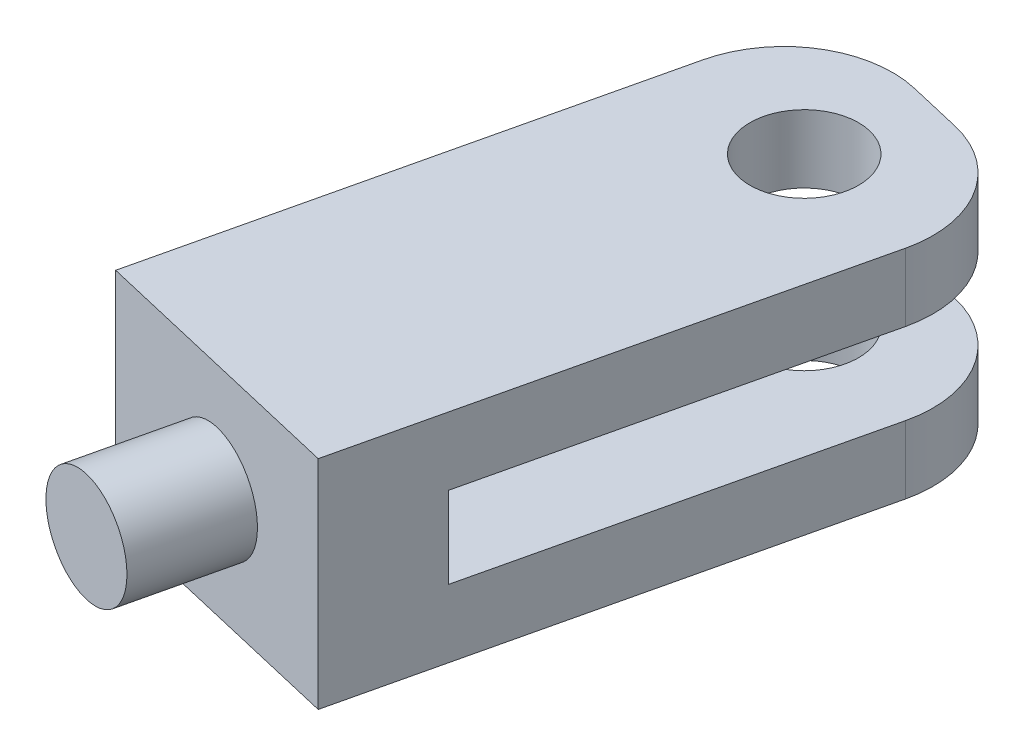
ISO-10303-21;
HEADER;
FILE_DESCRIPTION(('STEP AP214'),'2;1');
FILE_NAME('part.step','',(''),(''),'','','');
FILE_SCHEMA(('AUTOMOTIVE_DESIGN { 1 0 10303 214 1 1 1 1 }'));
ENDSEC;
DATA;
#1=APPLICATION_CONTEXT('core data for automotive mechanical design processes');
#2=APPLICATION_PROTOCOL_DEFINITION('international standard','automotive_design',2000,#1);
#3=PRODUCT_CONTEXT('',#1,'mechanical');
#4=PRODUCT('Part','Part','',(#3));
#5=PRODUCT_RELATED_PRODUCT_CATEGORY('part','',(#4));
#6=PRODUCT_DEFINITION_FORMATION('','',#4);
#7=PRODUCT_DEFINITION_CONTEXT('part definition',#1,'design');
#8=PRODUCT_DEFINITION('design','',#6,#7);
#9=PRODUCT_DEFINITION_SHAPE('','',#8);
#10=(LENGTH_UNIT() NAMED_UNIT(*) SI_UNIT(.MILLI.,.METRE.));
#11=(NAMED_UNIT(*) PLANE_ANGLE_UNIT() SI_UNIT($,.RADIAN.));
#12=(NAMED_UNIT(*) SI_UNIT($,.STERADIAN.) SOLID_ANGLE_UNIT());
#13=UNCERTAINTY_MEASURE_WITH_UNIT(LENGTH_MEASURE(1.E-05),#10,'distance_accuracy_value','');
#14=(GEOMETRIC_REPRESENTATION_CONTEXT(3) GLOBAL_UNCERTAINTY_ASSIGNED_CONTEXT((#13)) GLOBAL_UNIT_ASSIGNED_CONTEXT((#10,
#11,#12)) REPRESENTATION_CONTEXT('',''));
#15=CARTESIAN_POINT('',(0.,0.,0.));
#16=DIRECTION('',(0.,0.,1.));
#17=DIRECTION('',(1.,0.,0.));
#18=AXIS2_PLACEMENT_3D('',#15,#16,#17);
#19=CARTESIAN_POINT('',(-73.7479802413137,-39.9999999999999,95.7143427618182));
#20=DIRECTION('',(-0.227846622496821,0.,0.973697035333266));
#21=DIRECTION('',(0.973697035333266,0.,0.227846622496821));
#22=AXIS2_PLACEMENT_3D('',#19,#20,#21);
#23=PLANE('',#22);
#24=DIRECTION('',(0.973697035333266,0.,0.227846622496821));
#25=VECTOR('',#24,1.);
#26=CARTESIAN_POINT('',(-73.7479802413137,0.,95.7143427618182));
#27=LINE('',#26,#25);
#28=CARTESIAN_POINT('',(-73.7479802413137,0.,95.7143427618182));
#29=VERTEX_POINT('',#28);
#30=CARTESIAN_POINT('',(-25.0631284746504,0.,107.106673886659));
#31=VERTEX_POINT('',#30);
#32=EDGE_CURVE('E162',#29,#31,#27,.T.);
#33=ORIENTED_EDGE('',*,*,#32,.F.);
#34=DIRECTION('',(0.,1.,0.));
#35=VECTOR('',#34,1.);
#36=CARTESIAN_POINT('',(-73.7479802413137,-39.9999999999999,95.7143427618182));
#37=LINE('',#36,#35);
#38=CARTESIAN_POINT('',(-73.7479802413137,-39.9999999999999,95.7143427618182));
#39=VERTEX_POINT('',#38);
#40=EDGE_CURVE('E169',#39,#29,#37,.T.);
#41=ORIENTED_EDGE('',*,*,#40,.F.);
#42=DIRECTION('',(0.973697035333266,0.,0.227846622496821));
#43=VECTOR('',#42,1.);
#44=CARTESIAN_POINT('',(-73.7479802413137,-39.9999999999999,95.7143427618182));
#45=LINE('',#44,#43);
#46=CARTESIAN_POINT('',(-25.0631284746504,-39.9999999999999,107.106673886659));
#47=VERTEX_POINT('',#46);
#48=EDGE_CURVE('E167',#39,#47,#45,.T.);
#49=ORIENTED_EDGE('',*,*,#48,.T.);
#50=DIRECTION('',(0.,1.,0.));
#51=VECTOR('',#50,1.);
#52=CARTESIAN_POINT('',(-25.0631284746504,-39.9999999999999,107.106673886659));
#53=LINE('',#52,#51);
#54=EDGE_CURVE('E176',#47,#31,#53,.T.);
#55=ORIENTED_EDGE('',*,*,#54,.T.);
#56=EDGE_LOOP('',(#33,#41,#49,#55));
#57=FACE_BOUND('',#56,.T.);
#58=CARTESIAN_POINT('',(-49.4055543579819,-20.,101.410508324238));
#59=DIRECTION('',(-0.227846622496821,0.,0.973697035333266));
#60=DIRECTION('',(0.973697035333266,0.,0.227846622496821));
#61=AXIS2_PLACEMENT_3D('',#58,#59,#60);
#62=CIRCLE('',#61,9.99999999999978);
#63=CARTESIAN_POINT('',(-39.6685840046494,-20.,103.688974549206));
#64=VERTEX_POINT('',#63);
#65=EDGE_CURVE('E292',#64,#64,#62,.T.);
#66=ORIENTED_EDGE('',*,*,#65,.F.);
#67=EDGE_LOOP('',(#66));
#68=FACE_BOUND('',#67,.T.);
#69=ADVANCED_FACE('F34',(#57,#68),#23,.T.);
#70=CARTESIAN_POINT('',(-25.0631284746504,-39.9999999999999,107.106673886659));
#71=DIRECTION('',(0.973697035333266,0.,0.227846622496821));
#72=DIRECTION('',(0.227846622496821,0.,-0.973697035333266));
#73=AXIS2_PLACEMENT_3D('',#70,#71,#72);
#74=PLANE('',#73);
#75=DIRECTION('',(0.227846622496821,0.,-0.973697035333266));
#76=VECTOR('',#75,1.);
#77=CARTESIAN_POINT('',(-25.0631284746504,-39.9999999999999,107.106673886659));
#78=LINE('',#77,#76);
#79=CARTESIAN_POINT('',(-4.55693244993642,-39.9999999999999,19.4739407066653));
#80=VERTEX_POINT('',#79);
#81=EDGE_CURVE('E158',#47,#80,#78,.T.);
#82=ORIENTED_EDGE('',*,*,#81,.T.);
#83=DIRECTION('',(0.,1.,0.));
#84=VECTOR('',#83,1.);
#85=CARTESIAN_POINT('',(-4.55693244993643,-39.9999999999999,19.4739407066653));
#86=LINE('',#85,#84);
#87=CARTESIAN_POINT('',(-4.55693244993632,-27.5,19.4739407066653));
#88=VERTEX_POINT('',#87);
#89=EDGE_CURVE('E199',#80,#88,#86,.T.);
#90=ORIENTED_EDGE('',*,*,#89,.T.);
#91=DIRECTION('',(0.227846622496822,0.,-0.973697035333266));
#92=VECTOR('',#91,1.);
#93=CARTESIAN_POINT('',(-20.5061960247139,-27.5,87.6327331799939));
#94=LINE('',#93,#92);
#95=CARTESIAN_POINT('',(-20.5061960247139,-27.5,87.6327331799939));
#96=VERTEX_POINT('',#95);
#97=EDGE_CURVE('E154',#96,#88,#94,.T.);
#98=ORIENTED_EDGE('',*,*,#97,.F.);
#99=DIRECTION('',(0.,1.,0.));
#100=VECTOR('',#99,1.);
#101=CARTESIAN_POINT('',(-20.5061960247139,-27.5,87.6327331799939));
#102=LINE('',#101,#100);
#103=CARTESIAN_POINT('',(-20.5061960247139,-12.4999999999999,87.6327331799939));
#104=VERTEX_POINT('',#103);
#105=EDGE_CURVE('E219',#96,#104,#102,.T.);
#106=ORIENTED_EDGE('',*,*,#105,.T.);
#107=DIRECTION('',(0.227846622496822,0.,-0.973697035333266));
#108=VECTOR('',#107,1.);
#109=CARTESIAN_POINT('',(-20.5061960247139,-12.4999999999999,87.6327331799939));
#110=LINE('',#109,#108);
#111=CARTESIAN_POINT('',(-4.55693244993632,-12.4999999999999,19.4739407066653));
#112=VERTEX_POINT('',#111);
#113=EDGE_CURVE('E143',#104,#112,#110,.T.);
#114=ORIENTED_EDGE('',*,*,#113,.T.);
#115=DIRECTION('',(0.,1.,0.));
#116=VECTOR('',#115,1.);
#117=CARTESIAN_POINT('',(-4.55693244993643,-39.9999999999999,19.4739407066653));
#118=LINE('',#117,#116);
#119=CARTESIAN_POINT('',(-4.55693244993642,0.,19.4739407066653));
#120=VERTEX_POINT('',#119);
#121=EDGE_CURVE('E196',#112,#120,#118,.T.);
#122=ORIENTED_EDGE('',*,*,#121,.T.);
#123=DIRECTION('',(0.227846622496821,0.,-0.973697035333266));
#124=VECTOR('',#123,1.);
#125=CARTESIAN_POINT('',(-25.0631284746504,0.,107.106673886659));
#126=LINE('',#125,#124);
#127=EDGE_CURVE('E149',#31,#120,#126,.T.);
#128=ORIENTED_EDGE('',*,*,#127,.F.);
#129=ORIENTED_EDGE('',*,*,#54,.F.);
#130=EDGE_LOOP('',(#82,#90,#98,#106,#114,#122,#128,#129));
#131=FACE_BOUND('',#130,.T.);
#132=ADVANCED_FACE('F216',(#131),#74,.T.);
#133=CARTESIAN_POINT('',(-48.6848517666633,-39.9999999999999,-11.3923311248411));
#134=DIRECTION('',(-0.973697035333266,0.,-0.227846622496822));
#135=DIRECTION('',(-0.227846622496822,0.,0.973697035333266));
#136=AXIS2_PLACEMENT_3D('',#133,#134,#135);
#137=PLANE('',#136);
#138=DIRECTION('',(0.227846622496822,0.,-0.973697035333266));
#139=VECTOR('',#138,1.);
#140=CARTESIAN_POINT('',(-69.1910477913772,-27.5,76.2404020551528));
#141=LINE('',#140,#139);
#142=CARTESIAN_POINT('',(-69.1910477913772,-27.5,76.2404020551528));
#143=VERTEX_POINT('',#142);
#144=CARTESIAN_POINT('',(-53.2417842165997,-27.5,8.08160958182423));
#145=VERTEX_POINT('',#144);
#146=EDGE_CURVE('E150',#143,#145,#141,.T.);
#147=ORIENTED_EDGE('',*,*,#146,.T.);
#148=DIRECTION('',(0.,1.,0.));
#149=VECTOR('',#148,1.);
#150=CARTESIAN_POINT('',(-53.2417842165997,-39.9999999999999,8.08160958182424));
#151=LINE('',#150,#149);
#152=CARTESIAN_POINT('',(-53.2417842165997,-39.9999999999999,8.08160958182424));
#153=VERTEX_POINT('',#152);
#154=EDGE_CURVE('E190',#145,#153,#151,.F.);
#155=ORIENTED_EDGE('',*,*,#154,.T.);
#156=DIRECTION('',(-0.227846622496822,0.,0.973697035333266));
#157=VECTOR('',#156,1.);
#158=CARTESIAN_POINT('',(-48.6848517666633,-39.9999999999999,-11.3923311248411));
#159=LINE('',#158,#157);
#160=EDGE_CURVE('E165',#153,#39,#159,.T.);
#161=ORIENTED_EDGE('',*,*,#160,.T.);
#162=ORIENTED_EDGE('',*,*,#40,.T.);
#163=DIRECTION('',(-0.227846622496822,0.,0.973697035333266));
#164=VECTOR('',#163,1.);
#165=CARTESIAN_POINT('',(-48.6848517666633,0.,-11.3923311248411));
#166=LINE('',#165,#164);
#167=CARTESIAN_POINT('',(-53.2417842165997,0.,8.08160958182424));
#168=VERTEX_POINT('',#167);
#169=EDGE_CURVE('E172',#168,#29,#166,.T.);
#170=ORIENTED_EDGE('',*,*,#169,.F.);
#171=DIRECTION('',(0.,1.,0.));
#172=VECTOR('',#171,1.);
#173=CARTESIAN_POINT('',(-53.2417842165997,-39.9999999999999,8.08160958182424));
#174=LINE('',#173,#172);
#175=CARTESIAN_POINT('',(-53.2417842165997,-12.4999999999999,8.08160958182423));
#176=VERTEX_POINT('',#175);
#177=EDGE_CURVE('E148',#168,#176,#174,.F.);
#178=ORIENTED_EDGE('',*,*,#177,.T.);
#179=DIRECTION('',(0.227846622496822,0.,-0.973697035333266));
#180=VECTOR('',#179,1.);
#181=CARTESIAN_POINT('',(-69.1910477913772,-12.4999999999999,76.2404020551529));
#182=LINE('',#181,#180);
#183=CARTESIAN_POINT('',(-69.1910477913772,-12.4999999999999,76.2404020551529));
#184=VERTEX_POINT('',#183);
#185=EDGE_CURVE('E140',#184,#176,#182,.T.);
#186=ORIENTED_EDGE('',*,*,#185,.F.);
#187=DIRECTION('',(0.,-1.,0.));
#188=VECTOR('',#187,1.);
#189=CARTESIAN_POINT('',(-69.1910477913772,-12.4999999999999,76.2404020551529));
#190=LINE('',#189,#188);
#191=EDGE_CURVE('E126',#184,#143,#190,.T.);
#192=ORIENTED_EDGE('',*,*,#191,.T.);
#193=EDGE_LOOP('',(#147,#155,#161,#162,#170,#178,#186,#192));
#194=FACE_BOUND('',#193,.T.);
#195=ADVANCED_FACE('F146',(#194),#137,.T.);
#196=CARTESIAN_POINT('',(0.,-39.9999999999999,0.));
#197=DIRECTION('',(0.227846622496822,0.,-0.973697035333266));
#198=DIRECTION('',(-0.973697035333266,0.,-0.227846622496822));
#199=AXIS2_PLACEMENT_3D('',#196,#197,#198);
#200=PLANE('',#199);
#201=DIRECTION('',(-0.973697035333266,0.,-0.227846622496822));
#202=VECTOR('',#201,1.);
#203=CARTESIAN_POINT('',(1.11022302462516E-13,-12.4999999999999,0.));
#204=LINE('',#203,#202);
#205=CARTESIAN_POINT('',(-19.4739407066653,-12.4999999999999,-4.55693244993643));
#206=VERTEX_POINT('',#205);
#207=CARTESIAN_POINT('',(-29.210911059998,-12.4999999999999,-6.83539867490465));
#208=VERTEX_POINT('',#207);
#209=EDGE_CURVE('E211',#206,#208,#204,.T.);
#210=ORIENTED_EDGE('',*,*,#209,.T.);
#211=DIRECTION('',(0.,1.,0.));
#212=VECTOR('',#211,1.);
#213=CARTESIAN_POINT('',(-29.210911059998,-39.9999999999999,-6.83539867490465));
#214=LINE('',#213,#212);
#215=CARTESIAN_POINT('',(-29.210911059998,0.,-6.83539867490465));
#216=VERTEX_POINT('',#215);
#217=EDGE_CURVE('E204',#208,#216,#214,.T.);
#218=ORIENTED_EDGE('',*,*,#217,.T.);
#219=DIRECTION('',(-0.973697035333266,0.,-0.227846622496822));
#220=VECTOR('',#219,1.);
#221=CARTESIAN_POINT('',(0.,0.,0.));
#222=LINE('',#221,#220);
#223=CARTESIAN_POINT('',(-19.4739407066653,0.,-4.55693244993643));
#224=VERTEX_POINT('',#223);
#225=EDGE_CURVE('E152',#224,#216,#222,.T.);
#226=ORIENTED_EDGE('',*,*,#225,.F.);
#227=DIRECTION('',(0.,1.,0.));
#228=VECTOR('',#227,1.);
#229=CARTESIAN_POINT('',(-19.4739407066653,-39.9999999999999,-4.55693244993643));
#230=LINE('',#229,#228);
#231=EDGE_CURVE('E202',#224,#206,#230,.F.);
#232=ORIENTED_EDGE('',*,*,#231,.T.);
#233=EDGE_LOOP('',(#210,#218,#226,#232));
#234=FACE_BOUND('',#233,.T.);
#235=ADVANCED_FACE('F222',(#234),#200,.T.);
#236=DIRECTION('',(-0.973697035333266,0.,-0.227846622496822));
#237=VECTOR('',#236,1.);
#238=CARTESIAN_POINT('',(0.,-39.9999999999999,0.));
#239=LINE('',#238,#237);
#240=CARTESIAN_POINT('',(-19.4739407066653,-39.9999999999999,-4.55693244993643));
#241=VERTEX_POINT('',#240);
#242=CARTESIAN_POINT('',(-29.210911059998,-39.9999999999999,-6.83539867490465));
#243=VERTEX_POINT('',#242);
#244=EDGE_CURVE('E161',#241,#243,#239,.T.);
#245=ORIENTED_EDGE('',*,*,#244,.T.);
#246=DIRECTION('',(0.,1.,0.));
#247=VECTOR('',#246,1.);
#248=CARTESIAN_POINT('',(-29.210911059998,-39.9999999999999,-6.83539867490465));
#249=LINE('',#248,#247);
#250=CARTESIAN_POINT('',(-29.210911059998,-27.5,-6.83539867490465));
#251=VERTEX_POINT('',#250);
#252=EDGE_CURVE('E182',#243,#251,#249,.T.);
#253=ORIENTED_EDGE('',*,*,#252,.T.);
#254=DIRECTION('',(0.973697035333266,0.,0.227846622496822));
#255=VECTOR('',#254,1.);
#256=CARTESIAN_POINT('',(-48.6848517666632,-27.5,-11.3923311248411));
#257=LINE('',#256,#255);
#258=CARTESIAN_POINT('',(-19.4739407066653,-27.5,-4.55693244993643));
#259=VERTEX_POINT('',#258);
#260=EDGE_CURVE('E144',#251,#259,#257,.T.);
#261=ORIENTED_EDGE('',*,*,#260,.T.);
#262=DIRECTION('',(0.,1.,0.));
#263=VECTOR('',#262,1.);
#264=CARTESIAN_POINT('',(-19.4739407066653,-39.9999999999999,-4.55693244993643));
#265=LINE('',#264,#263);
#266=EDGE_CURVE('E178',#259,#241,#265,.F.);
#267=ORIENTED_EDGE('',*,*,#266,.T.);
#268=EDGE_LOOP('',(#245,#253,#261,#267));
#269=FACE_BOUND('',#268,.T.);
#270=ADVANCED_FACE('F251',(#269),#200,.T.);
#271=CARTESIAN_POINT('',(0.,-39.9999999999999,0.));
#272=DIRECTION('',(0.,1.,0.));
#273=DIRECTION('',(0.,0.,1.));
#274=AXIS2_PLACEMENT_3D('',#271,#272,#273);
#275=PLANE('',#274);
#276=CARTESIAN_POINT('',(-28.8993583332681,-39.9999999999999,13.7777751442448));
#277=DIRECTION('',(0.,-1.,0.));
#278=DIRECTION('',(0.,0.,-1.));
#279=AXIS2_PLACEMENT_3D('',#276,#277,#278);
#280=CIRCLE('',#279,10.);
#281=CARTESIAN_POINT('',(-28.8993583332681,-39.9999999999999,3.77777514424476));
#282=VERTEX_POINT('',#281);
#283=EDGE_CURVE('E285',#282,#282,#280,.T.);
#284=ORIENTED_EDGE('',*,*,#283,.F.);
#285=EDGE_LOOP('',(#284));
#286=FACE_BOUND('',#285,.T.);
#287=ORIENTED_EDGE('',*,*,#160,.F.);
#288=CARTESIAN_POINT('',(-33.7678435099344,-39.9999999999999,12.6385420317607));
#289=DIRECTION('',(0.,1.,0.));
#290=DIRECTION('',(0.,0.,1.));
#291=AXIS2_PLACEMENT_3D('',#288,#289,#290);
#292=CIRCLE('',#291,20.);
#293=EDGE_CURVE('E194',#153,#243,#292,.F.);
#294=ORIENTED_EDGE('',*,*,#293,.T.);
#295=ORIENTED_EDGE('',*,*,#244,.F.);
#296=CARTESIAN_POINT('',(-24.0308731566017,-39.9999999999999,14.9170082567289));
#297=DIRECTION('',(0.,1.,0.));
#298=DIRECTION('',(0.,0.,1.));
#299=AXIS2_PLACEMENT_3D('',#296,#297,#298);
#300=CIRCLE('',#299,20.);
#301=EDGE_CURVE('E192',#241,#80,#300,.F.);
#302=ORIENTED_EDGE('',*,*,#301,.T.);
#303=ORIENTED_EDGE('',*,*,#81,.F.);
#304=ORIENTED_EDGE('',*,*,#48,.F.);
#305=EDGE_LOOP('',(#287,#294,#295,#302,#303,#304));
#306=FACE_BOUND('',#305,.T.);
#307=ADVANCED_FACE('F266',(#286,#306),#275,.F.);
#308=CARTESIAN_POINT('',(0.,0.,0.));
#309=DIRECTION('',(0.,1.,0.));
#310=DIRECTION('',(0.,0.,1.));
#311=AXIS2_PLACEMENT_3D('',#308,#309,#310);
#312=PLANE('',#311);
#313=CARTESIAN_POINT('',(-28.8993583332681,0.,13.7777751442448));
#314=DIRECTION('',(0.,-1.,0.));
#315=DIRECTION('',(0.,0.,-1.));
#316=AXIS2_PLACEMENT_3D('',#313,#314,#315);
#317=CIRCLE('',#316,10.);
#318=CARTESIAN_POINT('',(-28.8993583332681,0.,3.77777514424476));
#319=VERTEX_POINT('',#318);
#320=EDGE_CURVE('E288',#319,#319,#317,.T.);
#321=ORIENTED_EDGE('',*,*,#320,.T.);
#322=EDGE_LOOP('',(#321));
#323=FACE_BOUND('',#322,.T.);
#324=ORIENTED_EDGE('',*,*,#225,.T.);
#325=CARTESIAN_POINT('',(-33.7678435099344,0.,12.6385420317607));
#326=DIRECTION('',(0.,1.,0.));
#327=DIRECTION('',(0.,0.,1.));
#328=AXIS2_PLACEMENT_3D('',#325,#326,#327);
#329=CIRCLE('',#328,20.);
#330=EDGE_CURVE('E50',#216,#168,#329,.T.);
#331=ORIENTED_EDGE('',*,*,#330,.T.);
#332=ORIENTED_EDGE('',*,*,#169,.T.);
#333=ORIENTED_EDGE('',*,*,#32,.T.);
#334=ORIENTED_EDGE('',*,*,#127,.T.);
#335=CARTESIAN_POINT('',(-24.0308731566017,0.,14.9170082567289));
#336=DIRECTION('',(0.,1.,0.));
#337=DIRECTION('',(0.,0.,1.));
#338=AXIS2_PLACEMENT_3D('',#335,#336,#337);
#339=CIRCLE('',#338,20.);
#340=EDGE_CURVE('E58',#120,#224,#339,.T.);
#341=ORIENTED_EDGE('',*,*,#340,.T.);
#342=EDGE_LOOP('',(#324,#331,#332,#333,#334,#341));
#343=FACE_BOUND('',#342,.T.);
#344=ADVANCED_FACE('F223',(#323,#343),#312,.T.);
#345=CARTESIAN_POINT('',(-20.5061960247139,-12.4999999999999,87.6327331799939));
#346=DIRECTION('',(0.,-1.,0.));
#347=DIRECTION('',(1.,0.,0.));
#348=AXIS2_PLACEMENT_3D('',#345,#346,#347);
#349=PLANE('',#348);
#350=CARTESIAN_POINT('',(-28.8993583332681,-12.4999999999999,13.7777751442448));
#351=DIRECTION('',(0.,-1.,0.));
#352=DIRECTION('',(1.,0.,0.));
#353=AXIS2_PLACEMENT_3D('',#350,#351,#352);
#354=CIRCLE('',#353,10.);
#355=CARTESIAN_POINT('',(-18.8993583332681,-12.4999999999999,13.7777751442448));
#356=VERTEX_POINT('',#355);
#357=EDGE_CURVE('E280',#356,#356,#354,.T.);
#358=ORIENTED_EDGE('',*,*,#357,.F.);
#359=EDGE_LOOP('',(#358));
#360=FACE_BOUND('',#359,.T.);
#361=ORIENTED_EDGE('',*,*,#185,.T.);
#362=CARTESIAN_POINT('',(-33.7678435099344,-12.4999999999999,12.6385420317607));
#363=DIRECTION('',(0.,-1.,0.));
#364=DIRECTION('',(1.,0.,0.));
#365=AXIS2_PLACEMENT_3D('',#362,#363,#364);
#366=CIRCLE('',#365,20.);
#367=EDGE_CURVE('E11',#176,#208,#366,.T.);
#368=ORIENTED_EDGE('',*,*,#367,.T.);
#369=ORIENTED_EDGE('',*,*,#209,.F.);
#370=CARTESIAN_POINT('',(-24.0308731566017,-12.4999999999999,14.9170082567289));
#371=DIRECTION('',(0.,-1.,0.));
#372=DIRECTION('',(1.,0.,0.));
#373=AXIS2_PLACEMENT_3D('',#370,#371,#372);
#374=CIRCLE('',#373,20.);
#375=EDGE_CURVE('E43',#206,#112,#374,.T.);
#376=ORIENTED_EDGE('',*,*,#375,.T.);
#377=ORIENTED_EDGE('',*,*,#113,.F.);
#378=DIRECTION('',(-0.973697035333266,0.,-0.227846622496822));
#379=VECTOR('',#378,1.);
#380=CARTESIAN_POINT('',(-20.5061960247139,-12.4999999999999,87.6327331799939));
#381=LINE('',#380,#379);
#382=EDGE_CURVE('E130',#104,#184,#381,.T.);
#383=ORIENTED_EDGE('',*,*,#382,.T.);
#384=EDGE_LOOP('',(#361,#368,#369,#376,#377,#383));
#385=FACE_BOUND('',#384,.T.);
#386=ADVANCED_FACE('F139',(#360,#385),#349,.T.);
#387=CARTESIAN_POINT('',(-69.1910477913772,-27.5,76.2404020551528));
#388=DIRECTION('',(0.,1.,0.));
#389=DIRECTION('',(-1.,0.,0.));
#390=AXIS2_PLACEMENT_3D('',#387,#388,#389);
#391=PLANE('',#390);
#392=CARTESIAN_POINT('',(-28.8993583332681,-27.5,13.7777751442448));
#393=DIRECTION('',(0.,1.,0.));
#394=DIRECTION('',(-1.,0.,0.));
#395=AXIS2_PLACEMENT_3D('',#392,#393,#394);
#396=CIRCLE('',#395,10.);
#397=CARTESIAN_POINT('',(-38.8993583332681,-27.5,13.7777751442448));
#398=VERTEX_POINT('',#397);
#399=EDGE_CURVE('E38',#398,#398,#396,.T.);
#400=ORIENTED_EDGE('',*,*,#399,.F.);
#401=EDGE_LOOP('',(#400));
#402=FACE_BOUND('',#401,.T.);
#403=ORIENTED_EDGE('',*,*,#260,.F.);
#404=CARTESIAN_POINT('',(-33.7678435099344,-27.5,12.6385420317607));
#405=DIRECTION('',(0.,1.,0.));
#406=DIRECTION('',(-1.,0.,0.));
#407=AXIS2_PLACEMENT_3D('',#404,#405,#406);
#408=CIRCLE('',#407,20.);
#409=EDGE_CURVE('E187',#251,#145,#408,.T.);
#410=ORIENTED_EDGE('',*,*,#409,.T.);
#411=ORIENTED_EDGE('',*,*,#146,.F.);
#412=DIRECTION('',(0.973697035333266,0.,0.227846622496822));
#413=VECTOR('',#412,1.);
#414=CARTESIAN_POINT('',(-69.1910477913772,-27.5,76.2404020551528));
#415=LINE('',#414,#413);
#416=EDGE_CURVE('E132',#143,#96,#415,.T.);
#417=ORIENTED_EDGE('',*,*,#416,.T.);
#418=ORIENTED_EDGE('',*,*,#97,.T.);
#419=CARTESIAN_POINT('',(-24.0308731566017,-27.5,14.9170082567289));
#420=DIRECTION('',(0.,1.,0.));
#421=DIRECTION('',(-1.,0.,0.));
#422=AXIS2_PLACEMENT_3D('',#419,#420,#421);
#423=CIRCLE('',#422,20.);
#424=EDGE_CURVE('E185',#88,#259,#423,.T.);
#425=ORIENTED_EDGE('',*,*,#424,.T.);
#426=EDGE_LOOP('',(#403,#410,#411,#417,#418,#425));
#427=FACE_BOUND('',#426,.T.);
#428=ADVANCED_FACE('F258',(#402,#427),#391,.T.);
#429=CARTESIAN_POINT('',(-69.1910477913772,-12.4999999999999,76.2404020551529));
#430=DIRECTION('',(-0.227846622496822,0.,0.973697035333266));
#431=DIRECTION('',(0.973697035333266,0.,0.227846622496822));
#432=AXIS2_PLACEMENT_3D('',#429,#430,#431);
#433=PLANE('',#432);
#434=ORIENTED_EDGE('',*,*,#382,.F.);
#435=ORIENTED_EDGE('',*,*,#105,.F.);
#436=ORIENTED_EDGE('',*,*,#416,.F.);
#437=ORIENTED_EDGE('',*,*,#191,.F.);
#438=EDGE_LOOP('',(#434,#435,#436,#437));
#439=FACE_BOUND('',#438,.T.);
#440=ADVANCED_FACE('F128',(#439),#433,.F.);
#441=CARTESIAN_POINT('',(-33.7678435099344,-39.9999999999999,12.6385420317607));
#442=DIRECTION('',(0.,1.,0.));
#443=DIRECTION('',(0.,0.,1.));
#444=AXIS2_PLACEMENT_3D('',#441,#442,#443);
#445=CYLINDRICAL_SURFACE('',#444,20.);
#446=ORIENTED_EDGE('',*,*,#293,.F.);
#447=ORIENTED_EDGE('',*,*,#154,.F.);
#448=ORIENTED_EDGE('',*,*,#409,.F.);
#449=ORIENTED_EDGE('',*,*,#252,.F.);
#450=EDGE_LOOP('',(#446,#447,#448,#449));
#451=FACE_BOUND('',#450,.T.);
#452=ADVANCED_FACE('F234',(#451),#445,.T.);
#453=CARTESIAN_POINT('',(-24.0308731566017,-39.9999999999999,14.9170082567289));
#454=DIRECTION('',(0.,1.,0.));
#455=DIRECTION('',(0.,0.,1.));
#456=AXIS2_PLACEMENT_3D('',#453,#454,#455);
#457=CYLINDRICAL_SURFACE('',#456,20.);
#458=ORIENTED_EDGE('',*,*,#301,.F.);
#459=ORIENTED_EDGE('',*,*,#266,.F.);
#460=ORIENTED_EDGE('',*,*,#424,.F.);
#461=ORIENTED_EDGE('',*,*,#89,.F.);
#462=EDGE_LOOP('',(#458,#459,#460,#461));
#463=FACE_BOUND('',#462,.T.);
#464=ADVANCED_FACE('F228',(#463),#457,.T.);
#465=CARTESIAN_POINT('',(-33.7678435099344,-39.9999999999999,12.6385420317607));
#466=DIRECTION('',(0.,1.,0.));
#467=DIRECTION('',(0.,0.,1.));
#468=AXIS2_PLACEMENT_3D('',#465,#466,#467);
#469=CYLINDRICAL_SURFACE('',#468,20.);
#470=ORIENTED_EDGE('',*,*,#367,.F.);
#471=ORIENTED_EDGE('',*,*,#177,.F.);
#472=ORIENTED_EDGE('',*,*,#330,.F.);
#473=ORIENTED_EDGE('',*,*,#217,.F.);
#474=EDGE_LOOP('',(#470,#471,#472,#473));
#475=FACE_BOUND('',#474,.T.);
#476=ADVANCED_FACE('F226',(#475),#469,.T.);
#477=CARTESIAN_POINT('',(-24.0308731566017,-39.9999999999999,14.9170082567289));
#478=DIRECTION('',(0.,1.,0.));
#479=DIRECTION('',(0.,0.,1.));
#480=AXIS2_PLACEMENT_3D('',#477,#478,#479);
#481=CYLINDRICAL_SURFACE('',#480,20.);
#482=ORIENTED_EDGE('',*,*,#375,.F.);
#483=ORIENTED_EDGE('',*,*,#231,.F.);
#484=ORIENTED_EDGE('',*,*,#340,.F.);
#485=ORIENTED_EDGE('',*,*,#121,.F.);
#486=EDGE_LOOP('',(#482,#483,#484,#485));
#487=FACE_BOUND('',#486,.T.);
#488=ADVANCED_FACE('F36',(#487),#481,.T.);
#489=CARTESIAN_POINT('',(-28.8993583332681,0.,13.7777751442448));
#490=DIRECTION('',(0.,-1.,0.));
#491=DIRECTION('',(0.,0.,-1.));
#492=AXIS2_PLACEMENT_3D('',#489,#490,#491);
#493=CYLINDRICAL_SURFACE('',#492,10.);
#494=ORIENTED_EDGE('',*,*,#399,.T.);
#495=EDGE_LOOP('',(#494));
#496=FACE_BOUND('',#495,.T.);
#497=ORIENTED_EDGE('',*,*,#283,.T.);
#498=EDGE_LOOP('',(#497));
#499=FACE_BOUND('',#498,.T.);
#500=ADVANCED_FACE('F233',(#496,#499),#493,.F.);
#501=ORIENTED_EDGE('',*,*,#357,.T.);
#502=EDGE_LOOP('',(#501));
#503=FACE_BOUND('',#502,.T.);
#504=ORIENTED_EDGE('',*,*,#320,.F.);
#505=EDGE_LOOP('',(#504));
#506=FACE_BOUND('',#505,.T.);
#507=ADVANCED_FACE('F303',(#503,#506),#493,.F.);
#508=CARTESIAN_POINT('',(-53.9624868079183,-20.,120.884449030903));
#509=DIRECTION('',(0.227846622496822,0.,-0.973697035333266));
#510=DIRECTION('',(-0.973697035333266,0.,-0.227846622496822));
#511=AXIS2_PLACEMENT_3D('',#508,#509,#510);
#512=CYLINDRICAL_SURFACE('',#511,9.99999999999978);
#513=CARTESIAN_POINT('',(-53.9624868079183,-20.,120.884449030903));
#514=DIRECTION('',(-0.227846622496821,0.,0.973697035333266));
#515=DIRECTION('',(0.973697035333266,0.,0.227846622496821));
#516=AXIS2_PLACEMENT_3D('',#513,#514,#515);
#517=CIRCLE('',#516,9.99999999999978);
#518=CARTESIAN_POINT('',(-44.2255164545858,-20.,123.162915255872));
#519=VERTEX_POINT('',#518);
#520=EDGE_CURVE('E289',#519,#519,#517,.T.);
#521=ORIENTED_EDGE('',*,*,#520,.F.);
#522=EDGE_LOOP('',(#521));
#523=FACE_BOUND('',#522,.T.);
#524=ORIENTED_EDGE('',*,*,#65,.T.);
#525=EDGE_LOOP('',(#524));
#526=FACE_BOUND('',#525,.T.);
#527=ADVANCED_FACE('F300',(#523,#526),#512,.T.);
#528=CARTESIAN_POINT('',(-53.9624868079183,-20.,120.884449030903));
#529=DIRECTION('',(-0.227846622496821,0.,0.973697035333266));
#530=DIRECTION('',(0.973697035333266,0.,0.227846622496821));
#531=AXIS2_PLACEMENT_3D('',#528,#529,#530);
#532=PLANE('',#531);
#533=ORIENTED_EDGE('',*,*,#520,.T.);
#534=EDGE_LOOP('',(#533));
#535=FACE_BOUND('',#534,.T.);
#536=ADVANCED_FACE('F298',(#535),#532,.T.);
#537=CLOSED_SHELL('',(#69,#132,#195,#235,#270,#307,#344,#386,#428,#440,#452,#464,#476,#488,#500,
#507,#527,#536));
#538=MANIFOLD_SOLID_BREP('B2',#537);
#539=ADVANCED_BREP_SHAPE_REPRESENTATION('',(#18,#538),#14);
#540=SHAPE_DEFINITION_REPRESENTATION(#9,#539);
ENDSEC;
END-ISO-10303-21;
